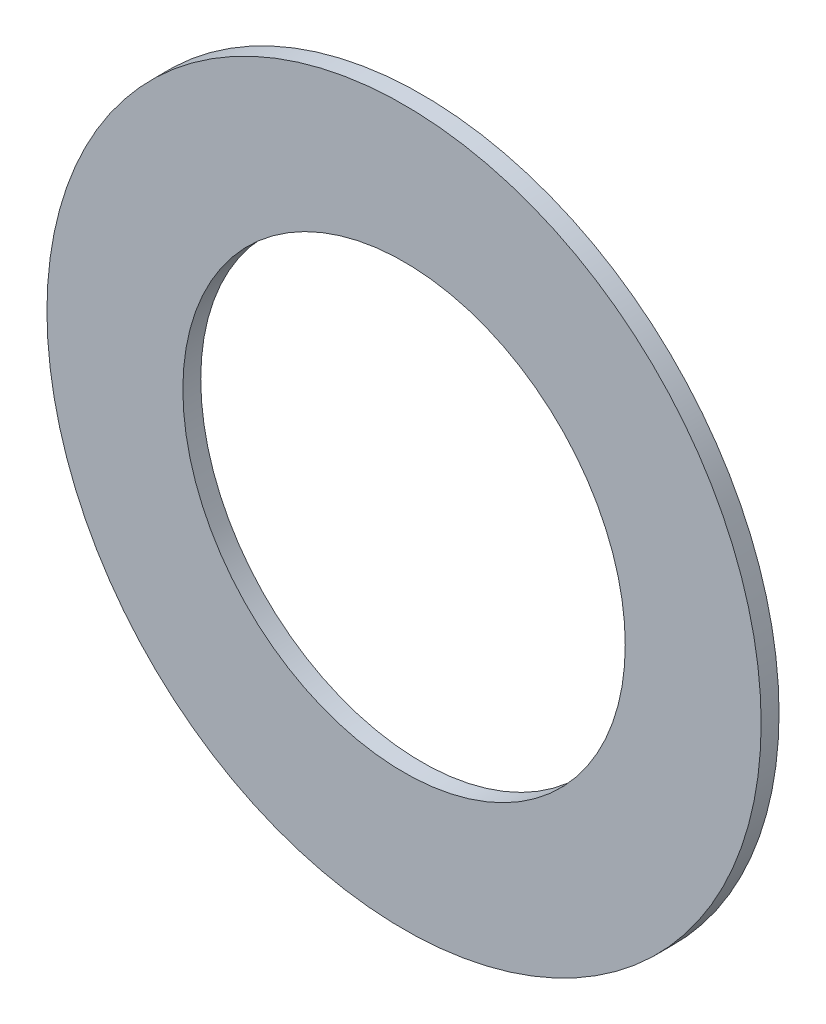
ISO-10303-21;
HEADER;
FILE_DESCRIPTION(('STEP AP214'),'2;1');
FILE_NAME('part.step','',(''),(''),'','','');
FILE_SCHEMA(('AUTOMOTIVE_DESIGN { 1 0 10303 214 1 1 1 1 }'));
ENDSEC;
DATA;
#1=APPLICATION_CONTEXT('core data for automotive mechanical design processes');
#2=APPLICATION_PROTOCOL_DEFINITION('international standard','automotive_design',2000,#1);
#3=PRODUCT_CONTEXT('',#1,'mechanical');
#4=PRODUCT('Part','Part','',(#3));
#5=PRODUCT_RELATED_PRODUCT_CATEGORY('part','',(#4));
#6=PRODUCT_DEFINITION_FORMATION('','',#4);
#7=PRODUCT_DEFINITION_CONTEXT('part definition',#1,'design');
#8=PRODUCT_DEFINITION('design','',#6,#7);
#9=PRODUCT_DEFINITION_SHAPE('','',#8);
#10=(LENGTH_UNIT() NAMED_UNIT(*) SI_UNIT(.MILLI.,.METRE.));
#11=(NAMED_UNIT(*) PLANE_ANGLE_UNIT() SI_UNIT($,.RADIAN.));
#12=(NAMED_UNIT(*) SI_UNIT($,.STERADIAN.) SOLID_ANGLE_UNIT());
#13=UNCERTAINTY_MEASURE_WITH_UNIT(LENGTH_MEASURE(1.E-05),#10,'distance_accuracy_value','');
#14=(GEOMETRIC_REPRESENTATION_CONTEXT(3) GLOBAL_UNCERTAINTY_ASSIGNED_CONTEXT((#13)) GLOBAL_UNIT_ASSIGNED_CONTEXT((#10,
#11,#12)) REPRESENTATION_CONTEXT('',''));
#15=CARTESIAN_POINT('',(0.,0.,0.));
#16=DIRECTION('',(0.,0.,1.));
#17=DIRECTION('',(1.,0.,0.));
#18=AXIS2_PLACEMENT_3D('',#15,#16,#17);
#19=CARTESIAN_POINT('',(0.,0.,3.175));
#20=DIRECTION('',(0.,0.,1.));
#21=DIRECTION('',(1.,0.,0.));
#22=AXIS2_PLACEMENT_3D('',#19,#20,#21);
#23=PLANE('',#22);
#24=CARTESIAN_POINT('',(0.,0.,3.175));
#25=DIRECTION('',(0.,0.,1.));
#26=DIRECTION('',(1.,0.,0.));
#27=AXIS2_PLACEMENT_3D('',#24,#25,#26);
#28=CIRCLE('',#27,63.373);
#29=CARTESIAN_POINT('',(63.373,0.,3.175));
#30=VERTEX_POINT('',#29);
#31=EDGE_CURVE('E10',#30,#30,#28,.T.);
#32=ORIENTED_EDGE('',*,*,#31,.T.);
#33=EDGE_LOOP('',(#32));
#34=FACE_BOUND('',#33,.T.);
#35=CARTESIAN_POINT('',(0.,0.,3.175));
#36=DIRECTION('',(0.,0.,1.));
#37=DIRECTION('',(1.,0.,0.));
#38=AXIS2_PLACEMENT_3D('',#35,#36,#37);
#39=CIRCLE('',#38,39.2557);
#40=CARTESIAN_POINT('',(39.2557,0.,3.175));
#41=VERTEX_POINT('',#40);
#42=EDGE_CURVE('E54',#41,#41,#39,.T.);
#43=ORIENTED_EDGE('',*,*,#42,.F.);
#44=EDGE_LOOP('',(#43));
#45=FACE_BOUND('',#44,.T.);
#46=ADVANCED_FACE('F43',(#34,#45),#23,.T.);
#47=CARTESIAN_POINT('',(0.,0.,0.));
#48=DIRECTION('',(0.,0.,1.));
#49=DIRECTION('',(1.,0.,0.));
#50=AXIS2_PLACEMENT_3D('',#47,#48,#49);
#51=PLANE('',#50);
#52=CARTESIAN_POINT('',(0.,0.,0.));
#53=DIRECTION('',(0.,0.,1.));
#54=DIRECTION('',(1.,0.,0.));
#55=AXIS2_PLACEMENT_3D('',#52,#53,#54);
#56=CIRCLE('',#55,63.373);
#57=CARTESIAN_POINT('',(63.373,0.,0.));
#58=VERTEX_POINT('',#57);
#59=EDGE_CURVE('E47',#58,#58,#56,.T.);
#60=ORIENTED_EDGE('',*,*,#59,.F.);
#61=EDGE_LOOP('',(#60));
#62=FACE_BOUND('',#61,.T.);
#63=CARTESIAN_POINT('',(0.,0.,0.));
#64=DIRECTION('',(0.,0.,1.));
#65=DIRECTION('',(1.,0.,0.));
#66=AXIS2_PLACEMENT_3D('',#63,#64,#65);
#67=CIRCLE('',#66,39.2557);
#68=CARTESIAN_POINT('',(39.2557,0.,0.));
#69=VERTEX_POINT('',#68);
#70=EDGE_CURVE('E56',#69,#69,#67,.T.);
#71=ORIENTED_EDGE('',*,*,#70,.T.);
#72=EDGE_LOOP('',(#71));
#73=FACE_BOUND('',#72,.T.);
#74=ADVANCED_FACE('F66',(#62,#73),#51,.F.);
#75=CARTESIAN_POINT('',(0.,0.,3.175));
#76=DIRECTION('',(0.,0.,-1.));
#77=DIRECTION('',(-1.,0.,0.));
#78=AXIS2_PLACEMENT_3D('',#75,#76,#77);
#79=CYLINDRICAL_SURFACE('',#78,63.373);
#80=ORIENTED_EDGE('',*,*,#31,.F.);
#81=EDGE_LOOP('',(#80));
#82=FACE_BOUND('',#81,.T.);
#83=ORIENTED_EDGE('',*,*,#59,.T.);
#84=EDGE_LOOP('',(#83));
#85=FACE_BOUND('',#84,.T.);
#86=ADVANCED_FACE('F45',(#82,#85),#79,.T.);
#87=CARTESIAN_POINT('',(0.,0.,3.175));
#88=DIRECTION('',(0.,0.,-1.));
#89=DIRECTION('',(-1.,0.,0.));
#90=AXIS2_PLACEMENT_3D('',#87,#88,#89);
#91=CYLINDRICAL_SURFACE('',#90,39.2557);
#92=ORIENTED_EDGE('',*,*,#42,.T.);
#93=EDGE_LOOP('',(#92));
#94=FACE_BOUND('',#93,.T.);
#95=ORIENTED_EDGE('',*,*,#70,.F.);
#96=EDGE_LOOP('',(#95));
#97=FACE_BOUND('',#96,.T.);
#98=ADVANCED_FACE('F62',(#94,#97),#91,.F.);
#99=CLOSED_SHELL('',(#46,#74,#86,#98));
#100=MANIFOLD_SOLID_BREP('B2',#99);
#101=ADVANCED_BREP_SHAPE_REPRESENTATION('',(#18,#100),#14);
#102=SHAPE_DEFINITION_REPRESENTATION(#9,#101);
ENDSEC;
END-ISO-10303-21;
